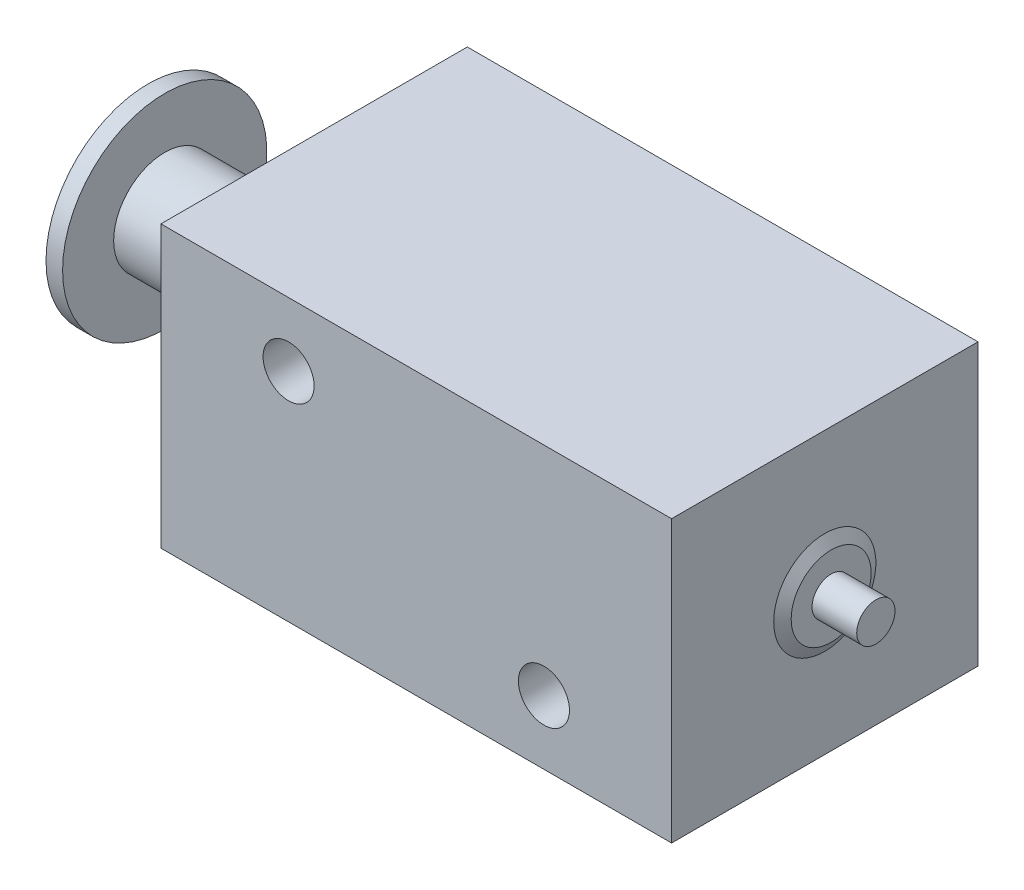
ISO-10303-21;
HEADER;
FILE_DESCRIPTION(('STEP AP214'),'2;1');
FILE_NAME('part.step','',(''),(''),'','','');
FILE_SCHEMA(('AUTOMOTIVE_DESIGN { 1 0 10303 214 1 1 1 1 }'));
ENDSEC;
DATA;
#1=APPLICATION_CONTEXT('core data for automotive mechanical design processes');
#2=APPLICATION_PROTOCOL_DEFINITION('international standard','automotive_design',2000,#1);
#3=PRODUCT_CONTEXT('',#1,'mechanical');
#4=PRODUCT('Part','Part','',(#3));
#5=PRODUCT_RELATED_PRODUCT_CATEGORY('part','',(#4));
#6=PRODUCT_DEFINITION_FORMATION('','',#4);
#7=PRODUCT_DEFINITION_CONTEXT('part definition',#1,'design');
#8=PRODUCT_DEFINITION('design','',#6,#7);
#9=PRODUCT_DEFINITION_SHAPE('','',#8);
#10=(LENGTH_UNIT() NAMED_UNIT(*) SI_UNIT(.MILLI.,.METRE.));
#11=(NAMED_UNIT(*) PLANE_ANGLE_UNIT() SI_UNIT($,.RADIAN.));
#12=(NAMED_UNIT(*) SI_UNIT($,.STERADIAN.) SOLID_ANGLE_UNIT());
#13=UNCERTAINTY_MEASURE_WITH_UNIT(LENGTH_MEASURE(1.E-05),#10,'distance_accuracy_value','');
#14=(GEOMETRIC_REPRESENTATION_CONTEXT(3) GLOBAL_UNCERTAINTY_ASSIGNED_CONTEXT((#13)) GLOBAL_UNIT_ASSIGNED_CONTEXT((#10,
#11,#12)) REPRESENTATION_CONTEXT('',''));
#15=CARTESIAN_POINT('',(0.,0.,0.));
#16=DIRECTION('',(0.,0.,1.));
#17=DIRECTION('',(1.,0.,0.));
#18=AXIS2_PLACEMENT_3D('',#15,#16,#17);
#19=CARTESIAN_POINT('',(-10.,5.5,-6.));
#20=DIRECTION('',(1.,0.,0.));
#21=DIRECTION('',(0.,0.,-1.));
#22=AXIS2_PLACEMENT_3D('',#19,#20,#21);
#23=PLANE('',#22);
#24=DIRECTION('',(0.,0.,1.));
#25=VECTOR('',#24,1.);
#26=CARTESIAN_POINT('',(-10.,-5.5,-6.));
#27=LINE('',#26,#25);
#28=CARTESIAN_POINT('',(-10.,-5.5,-6.));
#29=VERTEX_POINT('',#28);
#30=CARTESIAN_POINT('',(-10.,-5.5,6.));
#31=VERTEX_POINT('',#30);
#32=EDGE_CURVE('E99',#29,#31,#27,.T.);
#33=ORIENTED_EDGE('',*,*,#32,.T.);
#34=DIRECTION('',(0.,-1.,0.));
#35=VECTOR('',#34,1.);
#36=CARTESIAN_POINT('',(-10.,5.5,6.));
#37=LINE('',#36,#35);
#38=CARTESIAN_POINT('',(-10.,5.5,6.));
#39=VERTEX_POINT('',#38);
#40=EDGE_CURVE('E89',#39,#31,#37,.T.);
#41=ORIENTED_EDGE('',*,*,#40,.F.);
#42=DIRECTION('',(0.,0.,1.));
#43=VECTOR('',#42,1.);
#44=CARTESIAN_POINT('',(-10.,5.5,-6.));
#45=LINE('',#44,#43);
#46=CARTESIAN_POINT('',(-10.,5.5,-6.));
#47=VERTEX_POINT('',#46);
#48=EDGE_CURVE('E83',#47,#39,#45,.T.);
#49=ORIENTED_EDGE('',*,*,#48,.F.);
#50=DIRECTION('',(0.,-1.,0.));
#51=VECTOR('',#50,1.);
#52=CARTESIAN_POINT('',(-10.,5.5,-6.));
#53=LINE('',#52,#51);
#54=EDGE_CURVE('E95',#47,#29,#53,.T.);
#55=ORIENTED_EDGE('',*,*,#54,.T.);
#56=EDGE_LOOP('',(#33,#41,#49,#55));
#57=FACE_BOUND('',#56,.T.);
#58=CARTESIAN_POINT('',(-10.,0.,0.));
#59=DIRECTION('',(1.,0.,0.));
#60=DIRECTION('',(0.,0.,-1.));
#61=AXIS2_PLACEMENT_3D('',#58,#59,#60);
#62=CIRCLE('',#61,2.);
#63=CARTESIAN_POINT('',(-10.,0.,-2.));
#64=VERTEX_POINT('',#63);
#65=EDGE_CURVE('E11',#64,#64,#62,.F.);
#66=ORIENTED_EDGE('',*,*,#65,.F.);
#67=EDGE_LOOP('',(#66));
#68=FACE_BOUND('',#67,.T.);
#69=ADVANCED_FACE('F30',(#57,#68),#23,.F.);
#70=CARTESIAN_POINT('',(10.,5.5,-6.));
#71=DIRECTION('',(-1.,0.,0.));
#72=DIRECTION('',(0.,0.,1.));
#73=AXIS2_PLACEMENT_3D('',#70,#71,#72);
#74=PLANE('',#73);
#75=DIRECTION('',(0.,0.,-1.));
#76=VECTOR('',#75,1.);
#77=CARTESIAN_POINT('',(10.,-5.5,-6.));
#78=LINE('',#77,#76);
#79=CARTESIAN_POINT('',(10.,-5.5,6.));
#80=VERTEX_POINT('',#79);
#81=CARTESIAN_POINT('',(10.,-5.5,-6.));
#82=VERTEX_POINT('',#81);
#83=EDGE_CURVE('E64',#80,#82,#78,.T.);
#84=ORIENTED_EDGE('',*,*,#83,.T.);
#85=DIRECTION('',(0.,-1.,0.));
#86=VECTOR('',#85,1.);
#87=CARTESIAN_POINT('',(10.,5.5,-6.));
#88=LINE('',#87,#86);
#89=CARTESIAN_POINT('',(10.,5.5,-6.));
#90=VERTEX_POINT('',#89);
#91=EDGE_CURVE('E90',#90,#82,#88,.T.);
#92=ORIENTED_EDGE('',*,*,#91,.F.);
#93=DIRECTION('',(0.,0.,-1.));
#94=VECTOR('',#93,1.);
#95=CARTESIAN_POINT('',(10.,5.5,-6.));
#96=LINE('',#95,#94);
#97=CARTESIAN_POINT('',(10.,5.5,6.));
#98=VERTEX_POINT('',#97);
#99=EDGE_CURVE('E81',#98,#90,#96,.T.);
#100=ORIENTED_EDGE('',*,*,#99,.F.);
#101=DIRECTION('',(0.,-1.,0.));
#102=VECTOR('',#101,1.);
#103=CARTESIAN_POINT('',(10.,5.5,6.));
#104=LINE('',#103,#102);
#105=EDGE_CURVE('E86',#98,#80,#104,.T.);
#106=ORIENTED_EDGE('',*,*,#105,.T.);
#107=EDGE_LOOP('',(#84,#92,#100,#106));
#108=FACE_BOUND('',#107,.T.);
#109=CARTESIAN_POINT('',(10.,0.,0.));
#110=DIRECTION('',(-1.,0.,0.));
#111=DIRECTION('',(0.,0.,1.));
#112=AXIS2_PLACEMENT_3D('',#109,#110,#111);
#113=CIRCLE('',#112,2.);
#114=CARTESIAN_POINT('',(10.,0.,2.));
#115=VERTEX_POINT('',#114);
#116=EDGE_CURVE('E33',#115,#115,#113,.F.);
#117=ORIENTED_EDGE('',*,*,#116,.F.);
#118=EDGE_LOOP('',(#117));
#119=FACE_BOUND('',#118,.T.);
#120=ADVANCED_FACE('F92',(#108,#119),#74,.F.);
#121=CARTESIAN_POINT('',(-10.,5.5,6.));
#122=DIRECTION('',(0.,0.,-1.));
#123=DIRECTION('',(-1.,0.,0.));
#124=AXIS2_PLACEMENT_3D('',#121,#122,#123);
#125=PLANE('',#124);
#126=CARTESIAN_POINT('',(-5.,3.,6.));
#127=DIRECTION('',(0.,0.,1.));
#128=DIRECTION('',(1.,0.,0.));
#129=AXIS2_PLACEMENT_3D('',#126,#127,#128);
#130=CIRCLE('',#129,1.);
#131=CARTESIAN_POINT('',(-4.,3.,6.));
#132=VERTEX_POINT('',#131);
#133=EDGE_CURVE('E210',#132,#132,#130,.T.);
#134=ORIENTED_EDGE('',*,*,#133,.F.);
#135=EDGE_LOOP('',(#134));
#136=FACE_BOUND('',#135,.T.);
#137=CARTESIAN_POINT('',(5.,-3.,6.));
#138=DIRECTION('',(0.,0.,1.));
#139=DIRECTION('',(1.,0.,0.));
#140=AXIS2_PLACEMENT_3D('',#137,#138,#139);
#141=CIRCLE('',#140,1.);
#142=CARTESIAN_POINT('',(6.,-3.,6.));
#143=VERTEX_POINT('',#142);
#144=EDGE_CURVE('E215',#143,#143,#141,.T.);
#145=ORIENTED_EDGE('',*,*,#144,.F.);
#146=EDGE_LOOP('',(#145));
#147=FACE_BOUND('',#146,.T.);
#148=DIRECTION('',(1.,0.,0.));
#149=VECTOR('',#148,1.);
#150=CARTESIAN_POINT('',(-10.,-5.5,6.));
#151=LINE('',#150,#149);
#152=EDGE_CURVE('E88',#31,#80,#151,.T.);
#153=ORIENTED_EDGE('',*,*,#152,.T.);
#154=ORIENTED_EDGE('',*,*,#105,.F.);
#155=DIRECTION('',(1.,0.,0.));
#156=VECTOR('',#155,1.);
#157=CARTESIAN_POINT('',(-10.,5.5,6.));
#158=LINE('',#157,#156);
#159=EDGE_CURVE('E78',#39,#98,#158,.T.);
#160=ORIENTED_EDGE('',*,*,#159,.F.);
#161=ORIENTED_EDGE('',*,*,#40,.T.);
#162=EDGE_LOOP('',(#153,#154,#160,#161));
#163=FACE_BOUND('',#162,.T.);
#164=ADVANCED_FACE('F87',(#136,#147,#163),#125,.F.);
#165=CARTESIAN_POINT('',(-10.,5.5,-6.));
#166=DIRECTION('',(0.,0.,1.));
#167=DIRECTION('',(1.,0.,0.));
#168=AXIS2_PLACEMENT_3D('',#165,#166,#167);
#169=PLANE('',#168);
#170=DIRECTION('',(-1.,0.,0.));
#171=VECTOR('',#170,1.);
#172=CARTESIAN_POINT('',(-10.,-5.5,-6.));
#173=LINE('',#172,#171);
#174=EDGE_CURVE('E70',#82,#29,#173,.T.);
#175=ORIENTED_EDGE('',*,*,#174,.T.);
#176=ORIENTED_EDGE('',*,*,#54,.F.);
#177=DIRECTION('',(-1.,0.,0.));
#178=VECTOR('',#177,1.);
#179=CARTESIAN_POINT('',(-10.,5.5,-6.));
#180=LINE('',#179,#178);
#181=EDGE_CURVE('E47',#90,#47,#180,.T.);
#182=ORIENTED_EDGE('',*,*,#181,.F.);
#183=ORIENTED_EDGE('',*,*,#91,.T.);
#184=EDGE_LOOP('',(#175,#176,#182,#183));
#185=FACE_BOUND('',#184,.T.);
#186=ADVANCED_FACE('F118',(#185),#169,.F.);
#187=CARTESIAN_POINT('',(-10.,5.5,6.));
#188=DIRECTION('',(0.,1.,0.));
#189=DIRECTION('',(0.,0.,1.));
#190=AXIS2_PLACEMENT_3D('',#187,#188,#189);
#191=PLANE('',#190);
#192=ORIENTED_EDGE('',*,*,#48,.T.);
#193=ORIENTED_EDGE('',*,*,#159,.T.);
#194=ORIENTED_EDGE('',*,*,#99,.T.);
#195=ORIENTED_EDGE('',*,*,#181,.T.);
#196=EDGE_LOOP('',(#192,#193,#194,#195));
#197=FACE_BOUND('',#196,.T.);
#198=ADVANCED_FACE('F79',(#197),#191,.T.);
#199=CARTESIAN_POINT('',(-10.,-5.5,6.));
#200=DIRECTION('',(0.,1.,0.));
#201=DIRECTION('',(0.,0.,1.));
#202=AXIS2_PLACEMENT_3D('',#199,#200,#201);
#203=PLANE('',#202);
#204=ORIENTED_EDGE('',*,*,#32,.F.);
#205=ORIENTED_EDGE('',*,*,#174,.F.);
#206=ORIENTED_EDGE('',*,*,#83,.F.);
#207=ORIENTED_EDGE('',*,*,#152,.F.);
#208=EDGE_LOOP('',(#204,#205,#206,#207));
#209=FACE_BOUND('',#208,.T.);
#210=ADVANCED_FACE('F124',(#209),#203,.F.);
#211=CARTESIAN_POINT('',(5.,-3.,3.));
#212=DIRECTION('',(0.,0.,1.));
#213=DIRECTION('',(1.,0.,0.));
#214=AXIS2_PLACEMENT_3D('',#211,#212,#213);
#215=CYLINDRICAL_SURFACE('',#214,1.);
#216=CARTESIAN_POINT('',(5.,-3.,3.));
#217=DIRECTION('',(0.,0.,1.));
#218=DIRECTION('',(1.,0.,0.));
#219=AXIS2_PLACEMENT_3D('',#216,#217,#218);
#220=CIRCLE('',#219,1.);
#221=CARTESIAN_POINT('',(6.,-3.,3.));
#222=VERTEX_POINT('',#221);
#223=EDGE_CURVE('E102',#222,#222,#220,.T.);
#224=ORIENTED_EDGE('',*,*,#223,.F.);
#225=EDGE_LOOP('',(#224));
#226=FACE_BOUND('',#225,.T.);
#227=ORIENTED_EDGE('',*,*,#144,.T.);
#228=EDGE_LOOP('',(#227));
#229=FACE_BOUND('',#228,.T.);
#230=ADVANCED_FACE('F127',(#226,#229),#215,.F.);
#231=CARTESIAN_POINT('',(5.,-3.,3.));
#232=DIRECTION('',(0.,0.,1.));
#233=DIRECTION('',(1.,0.,0.));
#234=AXIS2_PLACEMENT_3D('',#231,#232,#233);
#235=PLANE('',#234);
#236=ORIENTED_EDGE('',*,*,#223,.T.);
#237=EDGE_LOOP('',(#236));
#238=FACE_BOUND('',#237,.T.);
#239=ADVANCED_FACE('F133',(#238),#235,.T.);
#240=CARTESIAN_POINT('',(-5.,3.,3.));
#241=DIRECTION('',(0.,0.,1.));
#242=DIRECTION('',(1.,0.,0.));
#243=AXIS2_PLACEMENT_3D('',#240,#241,#242);
#244=CYLINDRICAL_SURFACE('',#243,1.);
#245=CARTESIAN_POINT('',(-5.,3.,3.));
#246=DIRECTION('',(0.,0.,1.));
#247=DIRECTION('',(1.,0.,0.));
#248=AXIS2_PLACEMENT_3D('',#245,#246,#247);
#249=CIRCLE('',#248,1.);
#250=CARTESIAN_POINT('',(-4.,3.,3.));
#251=VERTEX_POINT('',#250);
#252=EDGE_CURVE('E212',#251,#251,#249,.T.);
#253=ORIENTED_EDGE('',*,*,#252,.F.);
#254=EDGE_LOOP('',(#253));
#255=FACE_BOUND('',#254,.T.);
#256=ORIENTED_EDGE('',*,*,#133,.T.);
#257=EDGE_LOOP('',(#256));
#258=FACE_BOUND('',#257,.T.);
#259=ADVANCED_FACE('F137',(#255,#258),#244,.F.);
#260=CARTESIAN_POINT('',(-5.,3.,3.));
#261=DIRECTION('',(0.,0.,1.));
#262=DIRECTION('',(1.,0.,0.));
#263=AXIS2_PLACEMENT_3D('',#260,#261,#262);
#264=PLANE('',#263);
#265=ORIENTED_EDGE('',*,*,#252,.T.);
#266=EDGE_LOOP('',(#265));
#267=FACE_BOUND('',#266,.T.);
#268=ADVANCED_FACE('F141',(#267),#264,.T.);
#269=CARTESIAN_POINT('',(12.,0.,0.));
#270=DIRECTION('',(-1.,0.,0.));
#271=DIRECTION('',(0.,0.,1.));
#272=AXIS2_PLACEMENT_3D('',#269,#270,#271);
#273=PLANE('',#272);
#274=CARTESIAN_POINT('',(12.,0.,0.));
#275=DIRECTION('',(-1.,0.,0.));
#276=DIRECTION('',(0.,0.,1.));
#277=AXIS2_PLACEMENT_3D('',#274,#275,#276);
#278=CIRCLE('',#277,0.75);
#279=CARTESIAN_POINT('',(12.,0.,0.75));
#280=VERTEX_POINT('',#279);
#281=EDGE_CURVE('E208',#280,#280,#278,.T.);
#282=ORIENTED_EDGE('',*,*,#281,.F.);
#283=EDGE_LOOP('',(#282));
#284=FACE_BOUND('',#283,.T.);
#285=ADVANCED_FACE('F145',(#284),#273,.F.);
#286=CARTESIAN_POINT('',(-17.5,0.,0.));
#287=DIRECTION('',(-1.,0.,0.));
#288=DIRECTION('',(0.,0.,1.));
#289=AXIS2_PLACEMENT_3D('',#286,#287,#288);
#290=CYLINDRICAL_SURFACE('',#289,0.75);
#291=CARTESIAN_POINT('',(10.25,0.,0.));
#292=DIRECTION('',(-1.,0.,0.));
#293=DIRECTION('',(0.,0.,1.));
#294=AXIS2_PLACEMENT_3D('',#291,#292,#293);
#295=CIRCLE('',#294,0.749999999999999);
#296=CARTESIAN_POINT('',(10.25,0.,0.749999999999999));
#297=VERTEX_POINT('',#296);
#298=EDGE_CURVE('E205',#297,#297,#295,.T.);
#299=ORIENTED_EDGE('',*,*,#298,.F.);
#300=EDGE_LOOP('',(#299));
#301=FACE_BOUND('',#300,.T.);
#302=ORIENTED_EDGE('',*,*,#281,.T.);
#303=EDGE_LOOP('',(#302));
#304=FACE_BOUND('',#303,.T.);
#305=ADVANCED_FACE('F149',(#301,#304),#290,.T.);
#306=CARTESIAN_POINT('',(10.25,0.,-0.749999999999999));
#307=DIRECTION('',(-1.,0.,0.));
#308=DIRECTION('',(0.,0.,1.));
#309=AXIS2_PLACEMENT_3D('',#306,#307,#308);
#310=PLANE('',#309);
#311=CARTESIAN_POINT('',(10.25,0.,0.));
#312=DIRECTION('',(-1.,0.,0.));
#313=DIRECTION('',(0.,0.,1.));
#314=AXIS2_PLACEMENT_3D('',#311,#312,#313);
#315=CIRCLE('',#314,1.56698729810779);
#316=CARTESIAN_POINT('',(10.25,0.,1.56698729810779));
#317=VERTEX_POINT('',#316);
#318=EDGE_CURVE('E202',#317,#317,#315,.T.);
#319=ORIENTED_EDGE('',*,*,#318,.F.);
#320=EDGE_LOOP('',(#319));
#321=FACE_BOUND('',#320,.T.);
#322=ORIENTED_EDGE('',*,*,#298,.T.);
#323=EDGE_LOOP('',(#322));
#324=FACE_BOUND('',#323,.T.);
#325=ADVANCED_FACE('F153',(#321,#324),#310,.F.);
#326=CARTESIAN_POINT('',(10.25,0.,0.));
#327=DIRECTION('',(-1.,0.,0.));
#328=DIRECTION('',(0.,0.,1.));
#329=AXIS2_PLACEMENT_3D('',#326,#327,#328);
#330=CONICAL_SURFACE('',#329,1.56698729810779,1.04719755119659);
#331=ORIENTED_EDGE('',*,*,#116,.T.);
#332=EDGE_LOOP('',(#331));
#333=FACE_BOUND('',#332,.T.);
#334=ORIENTED_EDGE('',*,*,#318,.T.);
#335=EDGE_LOOP('',(#334));
#336=FACE_BOUND('',#335,.T.);
#337=ADVANCED_FACE('F110',(#333,#336),#330,.T.);
#338=CARTESIAN_POINT('',(-17.5,0.,0.));
#339=DIRECTION('',(-1.,0.,0.));
#340=DIRECTION('',(0.,0.,1.));
#341=AXIS2_PLACEMENT_3D('',#338,#339,#340);
#342=CYLINDRICAL_SURFACE('',#341,2.);
#343=CARTESIAN_POINT('',(-15.85,0.,0.));
#344=DIRECTION('',(-1.,0.,0.));
#345=DIRECTION('',(0.,0.,1.));
#346=AXIS2_PLACEMENT_3D('',#343,#344,#345);
#347=CIRCLE('',#346,2.);
#348=CARTESIAN_POINT('',(-15.85,0.,2.));
#349=VERTEX_POINT('',#348);
#350=EDGE_CURVE('E199',#349,#349,#347,.T.);
#351=ORIENTED_EDGE('',*,*,#350,.F.);
#352=EDGE_LOOP('',(#351));
#353=FACE_BOUND('',#352,.T.);
#354=ORIENTED_EDGE('',*,*,#65,.T.);
#355=EDGE_LOOP('',(#354));
#356=FACE_BOUND('',#355,.T.);
#357=ADVANCED_FACE('F160',(#353,#356),#342,.T.);
#358=CARTESIAN_POINT('',(-15.85,0.,-2.));
#359=DIRECTION('',(-1.,0.,0.));
#360=DIRECTION('',(0.,0.,1.));
#361=AXIS2_PLACEMENT_3D('',#358,#359,#360);
#362=PLANE('',#361);
#363=CARTESIAN_POINT('',(-15.85,0.,0.));
#364=DIRECTION('',(-1.,0.,0.));
#365=DIRECTION('',(0.,0.,1.));
#366=AXIS2_PLACEMENT_3D('',#363,#364,#365);
#367=CIRCLE('',#366,4.);
#368=CARTESIAN_POINT('',(-15.85,0.,4.));
#369=VERTEX_POINT('',#368);
#370=EDGE_CURVE('E196',#369,#369,#367,.T.);
#371=ORIENTED_EDGE('',*,*,#370,.F.);
#372=EDGE_LOOP('',(#371));
#373=FACE_BOUND('',#372,.T.);
#374=ORIENTED_EDGE('',*,*,#350,.T.);
#375=EDGE_LOOP('',(#374));
#376=FACE_BOUND('',#375,.T.);
#377=ADVANCED_FACE('F163',(#373,#376),#362,.F.);
#378=CARTESIAN_POINT('',(-17.5,0.,0.));
#379=DIRECTION('',(-1.,0.,0.));
#380=DIRECTION('',(0.,0.,1.));
#381=AXIS2_PLACEMENT_3D('',#378,#379,#380);
#382=CYLINDRICAL_SURFACE('',#381,4.);
#383=CARTESIAN_POINT('',(-16.5,0.,0.));
#384=DIRECTION('',(-1.,0.,0.));
#385=DIRECTION('',(0.,0.,1.));
#386=AXIS2_PLACEMENT_3D('',#383,#384,#385);
#387=CIRCLE('',#386,4.);
#388=CARTESIAN_POINT('',(-16.5,0.,4.));
#389=VERTEX_POINT('',#388);
#390=EDGE_CURVE('E191',#389,#389,#387,.T.);
#391=ORIENTED_EDGE('',*,*,#390,.F.);
#392=EDGE_LOOP('',(#391));
#393=FACE_BOUND('',#392,.T.);
#394=ORIENTED_EDGE('',*,*,#370,.T.);
#395=EDGE_LOOP('',(#394));
#396=FACE_BOUND('',#395,.T.);
#397=ADVANCED_FACE('F167',(#393,#396),#382,.T.);
#398=CARTESIAN_POINT('',(-16.5,0.,-4.));
#399=DIRECTION('',(1.,0.,0.));
#400=DIRECTION('',(0.,0.,-1.));
#401=AXIS2_PLACEMENT_3D('',#398,#399,#400);
#402=PLANE('',#401);
#403=CARTESIAN_POINT('',(-16.5,0.,0.));
#404=DIRECTION('',(-1.,0.,0.));
#405=DIRECTION('',(0.,0.,1.));
#406=AXIS2_PLACEMENT_3D('',#403,#404,#405);
#407=CIRCLE('',#406,2.);
#408=CARTESIAN_POINT('',(-16.5,0.,2.));
#409=VERTEX_POINT('',#408);
#410=EDGE_CURVE('E188',#409,#409,#407,.T.);
#411=ORIENTED_EDGE('',*,*,#410,.F.);
#412=EDGE_LOOP('',(#411));
#413=FACE_BOUND('',#412,.T.);
#414=ORIENTED_EDGE('',*,*,#390,.T.);
#415=EDGE_LOOP('',(#414));
#416=FACE_BOUND('',#415,.T.);
#417=ADVANCED_FACE('F171',(#413,#416),#402,.F.);
#418=CARTESIAN_POINT('',(-17.5,0.,0.));
#419=DIRECTION('',(-1.,0.,0.));
#420=DIRECTION('',(0.,0.,1.));
#421=AXIS2_PLACEMENT_3D('',#418,#419,#420);
#422=CYLINDRICAL_SURFACE('',#421,2.);
#423=CARTESIAN_POINT('',(-17.5,0.,0.));
#424=DIRECTION('',(-1.,0.,0.));
#425=DIRECTION('',(0.,0.,1.));
#426=AXIS2_PLACEMENT_3D('',#423,#424,#425);
#427=CIRCLE('',#426,2.);
#428=CARTESIAN_POINT('',(-17.5,0.,2.));
#429=VERTEX_POINT('',#428);
#430=EDGE_CURVE('E187',#429,#429,#427,.T.);
#431=ORIENTED_EDGE('',*,*,#430,.F.);
#432=EDGE_LOOP('',(#431));
#433=FACE_BOUND('',#432,.T.);
#434=ORIENTED_EDGE('',*,*,#410,.T.);
#435=EDGE_LOOP('',(#434));
#436=FACE_BOUND('',#435,.T.);
#437=ADVANCED_FACE('F175',(#433,#436),#422,.T.);
#438=CARTESIAN_POINT('',(-17.5,0.,-2.));
#439=DIRECTION('',(1.,0.,0.));
#440=DIRECTION('',(0.,0.,-1.));
#441=AXIS2_PLACEMENT_3D('',#438,#439,#440);
#442=PLANE('',#441);
#443=ORIENTED_EDGE('',*,*,#430,.T.);
#444=EDGE_LOOP('',(#443));
#445=FACE_BOUND('',#444,.T.);
#446=ADVANCED_FACE('F179',(#445),#442,.F.);
#447=CLOSED_SHELL('',(#69,#120,#164,#186,#198,#210,#230,#239,#259,#268,#285,#305,#325,#337,#357,
#377,#397,#417,#437,#446));
#448=MANIFOLD_SOLID_BREP('B2',#447);
#449=ADVANCED_BREP_SHAPE_REPRESENTATION('',(#18,#448),#14);
#450=SHAPE_DEFINITION_REPRESENTATION(#9,#449);
ENDSEC;
END-ISO-10303-21;
